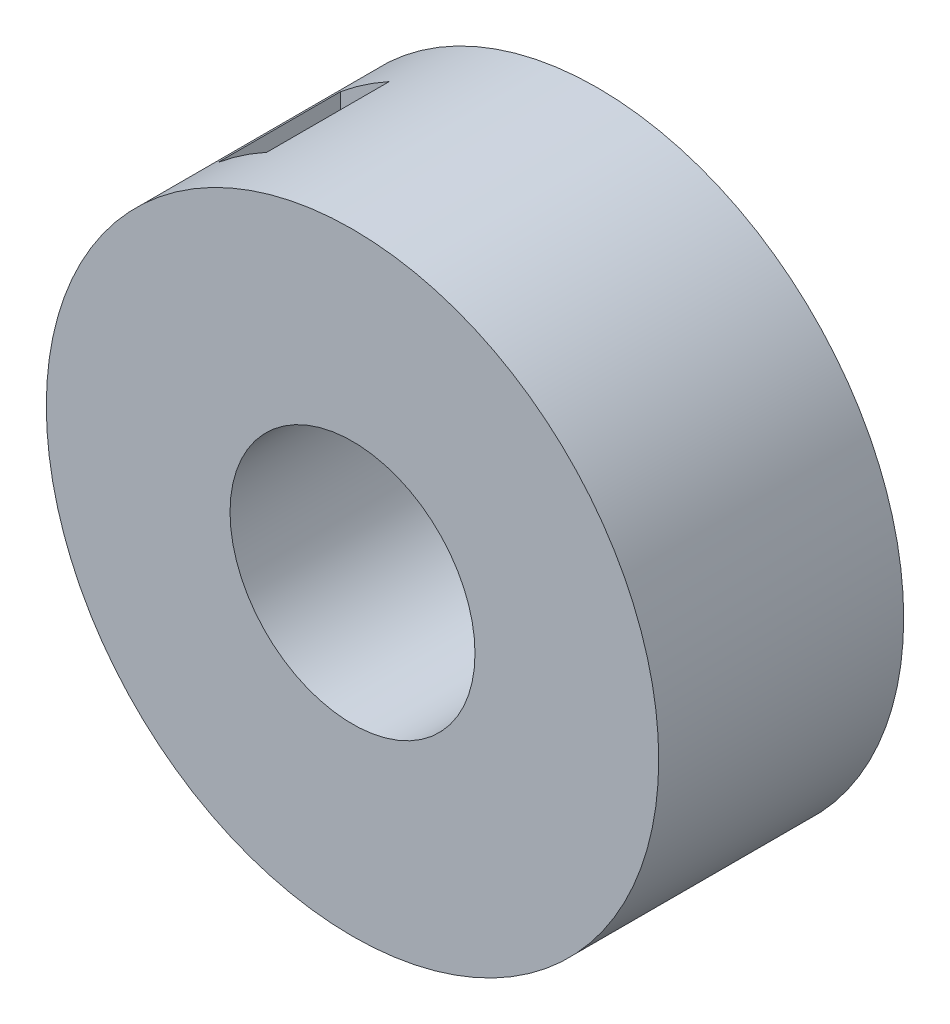
ISO-10303-21;
HEADER;
FILE_DESCRIPTION(('STEP AP214'),'2;1');
FILE_NAME('part.step','',(''),(''),'','','');
FILE_SCHEMA(('AUTOMOTIVE_DESIGN { 1 0 10303 214 1 1 1 1 }'));
ENDSEC;
DATA;
#1=APPLICATION_CONTEXT('core data for automotive mechanical design processes');
#2=APPLICATION_PROTOCOL_DEFINITION('international standard','automotive_design',2000,#1);
#3=PRODUCT_CONTEXT('',#1,'mechanical');
#4=PRODUCT('Part','Part','',(#3));
#5=PRODUCT_RELATED_PRODUCT_CATEGORY('part','',(#4));
#6=PRODUCT_DEFINITION_FORMATION('','',#4);
#7=PRODUCT_DEFINITION_CONTEXT('part definition',#1,'design');
#8=PRODUCT_DEFINITION('design','',#6,#7);
#9=PRODUCT_DEFINITION_SHAPE('','',#8);
#10=(LENGTH_UNIT() NAMED_UNIT(*) SI_UNIT(.MILLI.,.METRE.));
#11=(NAMED_UNIT(*) PLANE_ANGLE_UNIT() SI_UNIT($,.RADIAN.));
#12=(NAMED_UNIT(*) SI_UNIT($,.STERADIAN.) SOLID_ANGLE_UNIT());
#13=UNCERTAINTY_MEASURE_WITH_UNIT(LENGTH_MEASURE(1.E-05),#10,'distance_accuracy_value','');
#14=(GEOMETRIC_REPRESENTATION_CONTEXT(3) GLOBAL_UNCERTAINTY_ASSIGNED_CONTEXT((#13)) GLOBAL_UNIT_ASSIGNED_CONTEXT((#10,
#11,#12)) REPRESENTATION_CONTEXT('',''));
#15=CARTESIAN_POINT('',(0.,0.,0.));
#16=DIRECTION('',(0.,0.,1.));
#17=DIRECTION('',(1.,0.,0.));
#18=AXIS2_PLACEMENT_3D('',#15,#16,#17);
#19=CARTESIAN_POINT('',(0.,0.,-0.25));
#20=DIRECTION('',(0.,0.,1.));
#21=DIRECTION('',(1.,0.,0.));
#22=AXIS2_PLACEMENT_3D('',#19,#20,#21);
#23=CYLINDRICAL_SURFACE('',#22,0.625);
#24=CARTESIAN_POINT('',(0.,0.,0.125));
#25=DIRECTION('',(0.,0.,1.));
#26=DIRECTION('',(1.,0.,0.));
#27=AXIS2_PLACEMENT_3D('',#24,#25,#26);
#28=CIRCLE('',#27,0.625);
#29=CARTESIAN_POINT('',(-0.4,-0.480234317807463,0.125));
#30=VERTEX_POINT('',#29);
#31=CARTESIAN_POINT('',(-0.3,-0.548292804986533,0.125));
#32=VERTEX_POINT('',#31);
#33=EDGE_CURVE('E131',#30,#32,#28,.T.);
#34=ORIENTED_EDGE('',*,*,#33,.T.);
#35=DIRECTION('',(0.,0.,-1.));
#36=VECTOR('',#35,1.);
#37=CARTESIAN_POINT('',(-0.3,-0.548292804986533,0.125));
#38=LINE('',#37,#36);
#39=CARTESIAN_POINT('',(-0.3,-0.548292804986533,-0.125));
#40=VERTEX_POINT('',#39);
#41=EDGE_CURVE('E97',#32,#40,#38,.T.);
#42=ORIENTED_EDGE('',*,*,#41,.T.);
#43=CARTESIAN_POINT('',(0.,0.,-0.125));
#44=DIRECTION('',(0.,0.,1.));
#45=DIRECTION('',(1.,0.,0.));
#46=AXIS2_PLACEMENT_3D('',#43,#44,#45);
#47=CIRCLE('',#46,0.625);
#48=CARTESIAN_POINT('',(-0.4,-0.480234317807463,-0.125));
#49=VERTEX_POINT('',#48);
#50=EDGE_CURVE('E81',#49,#40,#47,.T.);
#51=ORIENTED_EDGE('',*,*,#50,.F.);
#52=DIRECTION('',(0.,0.,-1.));
#53=VECTOR('',#52,1.);
#54=CARTESIAN_POINT('',(-0.4,-0.480234317807463,0.125));
#55=LINE('',#54,#53);
#56=EDGE_CURVE('E79',#30,#49,#55,.T.);
#57=ORIENTED_EDGE('',*,*,#56,.F.);
#58=EDGE_LOOP('',(#34,#42,#51,#57));
#59=FACE_BOUND('',#58,.T.);
#60=CARTESIAN_POINT('',(0.,0.,0.125));
#61=DIRECTION('',(0.,0.,1.));
#62=DIRECTION('',(1.,0.,0.));
#63=AXIS2_PLACEMENT_3D('',#60,#61,#62);
#64=CIRCLE('',#63,0.625);
#65=CARTESIAN_POINT('',(-0.3,0.548292804986533,0.125));
#66=VERTEX_POINT('',#65);
#67=CARTESIAN_POINT('',(-0.4,0.480234317807464,0.125));
#68=VERTEX_POINT('',#67);
#69=EDGE_CURVE('E91',#66,#68,#64,.T.);
#70=ORIENTED_EDGE('',*,*,#69,.T.);
#71=DIRECTION('',(0.,0.,-1.));
#72=VECTOR('',#71,1.);
#73=CARTESIAN_POINT('',(-0.4,0.480234317807464,0.125));
#74=LINE('',#73,#72);
#75=CARTESIAN_POINT('',(-0.4,0.480234317807464,-0.125));
#76=VERTEX_POINT('',#75);
#77=EDGE_CURVE('E76',#68,#76,#74,.T.);
#78=ORIENTED_EDGE('',*,*,#77,.T.);
#79=CARTESIAN_POINT('',(0.,0.,-0.125));
#80=DIRECTION('',(0.,0.,1.));
#81=DIRECTION('',(1.,0.,0.));
#82=AXIS2_PLACEMENT_3D('',#79,#80,#81);
#83=CIRCLE('',#82,0.625);
#84=CARTESIAN_POINT('',(-0.3,0.548292804986533,-0.125));
#85=VERTEX_POINT('',#84);
#86=EDGE_CURVE('E82',#85,#76,#83,.T.);
#87=ORIENTED_EDGE('',*,*,#86,.F.);
#88=DIRECTION('',(0.,0.,-1.));
#89=VECTOR('',#88,1.);
#90=CARTESIAN_POINT('',(-0.3,0.548292804986533,0.125));
#91=LINE('',#90,#89);
#92=EDGE_CURVE('E137',#66,#85,#91,.T.);
#93=ORIENTED_EDGE('',*,*,#92,.F.);
#94=EDGE_LOOP('',(#70,#78,#87,#93));
#95=FACE_BOUND('',#94,.T.);
#96=CARTESIAN_POINT('',(0.,0.,-0.25));
#97=DIRECTION('',(0.,0.,1.));
#98=DIRECTION('',(1.,0.,0.));
#99=AXIS2_PLACEMENT_3D('',#96,#97,#98);
#100=CIRCLE('',#99,0.625);
#101=CARTESIAN_POINT('',(0.625,0.,-0.25));
#102=VERTEX_POINT('',#101);
#103=EDGE_CURVE('E11',#102,#102,#100,.T.);
#104=ORIENTED_EDGE('',*,*,#103,.T.);
#105=EDGE_LOOP('',(#104));
#106=FACE_BOUND('',#105,.T.);
#107=CARTESIAN_POINT('',(0.,0.,0.25));
#108=DIRECTION('',(0.,0.,1.));
#109=DIRECTION('',(1.,0.,0.));
#110=AXIS2_PLACEMENT_3D('',#107,#108,#109);
#111=CIRCLE('',#110,0.625);
#112=CARTESIAN_POINT('',(0.625,0.,0.25));
#113=VERTEX_POINT('',#112);
#114=EDGE_CURVE('E95',#113,#113,#111,.T.);
#115=ORIENTED_EDGE('',*,*,#114,.F.);
#116=EDGE_LOOP('',(#115));
#117=FACE_BOUND('',#116,.T.);
#118=ADVANCED_FACE('F36',(#59,#95,#106,#117),#23,.T.);
#119=CARTESIAN_POINT('',(0.,0.,-0.25));
#120=DIRECTION('',(0.,0.,1.));
#121=DIRECTION('',(1.,0.,0.));
#122=AXIS2_PLACEMENT_3D('',#119,#120,#121);
#123=PLANE('',#122);
#124=CARTESIAN_POINT('',(0.,0.,-0.25));
#125=DIRECTION('',(0.,0.,1.));
#126=DIRECTION('',(1.,0.,0.));
#127=AXIS2_PLACEMENT_3D('',#124,#125,#126);
#128=CIRCLE('',#127,0.25);
#129=CARTESIAN_POINT('',(0.25,0.,-0.25));
#130=VERTEX_POINT('',#129);
#131=EDGE_CURVE('E43',#130,#130,#128,.T.);
#132=ORIENTED_EDGE('',*,*,#131,.T.);
#133=EDGE_LOOP('',(#132));
#134=FACE_BOUND('',#133,.T.);
#135=ORIENTED_EDGE('',*,*,#103,.F.);
#136=EDGE_LOOP('',(#135));
#137=FACE_BOUND('',#136,.T.);
#138=ADVANCED_FACE('F105',(#134,#137),#123,.F.);
#139=CARTESIAN_POINT('',(0.,0.,-0.25));
#140=DIRECTION('',(0.,0.,1.));
#141=DIRECTION('',(1.,0.,0.));
#142=AXIS2_PLACEMENT_3D('',#139,#140,#141);
#143=CYLINDRICAL_SURFACE('',#142,0.25);
#144=ORIENTED_EDGE('',*,*,#131,.F.);
#145=EDGE_LOOP('',(#144));
#146=FACE_BOUND('',#145,.T.);
#147=CARTESIAN_POINT('',(0.,0.,0.25));
#148=DIRECTION('',(0.,0.,1.));
#149=DIRECTION('',(1.,0.,0.));
#150=AXIS2_PLACEMENT_3D('',#147,#148,#149);
#151=CIRCLE('',#150,0.25);
#152=CARTESIAN_POINT('',(0.25,0.,0.25));
#153=VERTEX_POINT('',#152);
#154=EDGE_CURVE('E92',#153,#153,#151,.T.);
#155=ORIENTED_EDGE('',*,*,#154,.T.);
#156=EDGE_LOOP('',(#155));
#157=FACE_BOUND('',#156,.T.);
#158=ADVANCED_FACE('F108',(#146,#157),#143,.F.);
#159=CARTESIAN_POINT('',(0.,0.,0.25));
#160=DIRECTION('',(0.,0.,1.));
#161=DIRECTION('',(1.,0.,0.));
#162=AXIS2_PLACEMENT_3D('',#159,#160,#161);
#163=PLANE('',#162);
#164=ORIENTED_EDGE('',*,*,#114,.T.);
#165=EDGE_LOOP('',(#164));
#166=FACE_BOUND('',#165,.T.);
#167=ORIENTED_EDGE('',*,*,#154,.F.);
#168=EDGE_LOOP('',(#167));
#169=FACE_BOUND('',#168,.T.);
#170=ADVANCED_FACE('F111',(#166,#169),#163,.T.);
#171=CARTESIAN_POINT('',(-0.4,-0.480234317807464,0.125));
#172=DIRECTION('',(1.,0.,0.));
#173=DIRECTION('',(0.,0.,-1.));
#174=AXIS2_PLACEMENT_3D('',#171,#172,#173);
#175=PLANE('',#174);
#176=ORIENTED_EDGE('',*,*,#77,.F.);
#177=DIRECTION('',(0.,-1.,0.));
#178=VECTOR('',#177,1.);
#179=CARTESIAN_POINT('',(-0.4,-0.480234317807464,0.125));
#180=LINE('',#179,#178);
#181=EDGE_CURVE('E135',#68,#30,#180,.T.);
#182=ORIENTED_EDGE('',*,*,#181,.T.);
#183=ORIENTED_EDGE('',*,*,#56,.T.);
#184=DIRECTION('',(0.,-1.,0.));
#185=VECTOR('',#184,1.);
#186=CARTESIAN_POINT('',(-0.4,-0.480234317807464,-0.125));
#187=LINE('',#186,#185);
#188=EDGE_CURVE('E50',#76,#49,#187,.T.);
#189=ORIENTED_EDGE('',*,*,#188,.F.);
#190=EDGE_LOOP('',(#176,#182,#183,#189));
#191=FACE_BOUND('',#190,.T.);
#192=ADVANCED_FACE('F74',(#191),#175,.T.);
#193=CARTESIAN_POINT('',(-0.3,-0.548292804986533,0.125));
#194=DIRECTION('',(-1.,0.,0.));
#195=DIRECTION('',(0.,0.,1.));
#196=AXIS2_PLACEMENT_3D('',#193,#194,#195);
#197=PLANE('',#196);
#198=ORIENTED_EDGE('',*,*,#41,.F.);
#199=DIRECTION('',(0.,1.,0.));
#200=VECTOR('',#199,1.);
#201=CARTESIAN_POINT('',(-0.3,-0.548292804986533,0.125));
#202=LINE('',#201,#200);
#203=EDGE_CURVE('E134',#32,#66,#202,.T.);
#204=ORIENTED_EDGE('',*,*,#203,.T.);
#205=ORIENTED_EDGE('',*,*,#92,.T.);
#206=DIRECTION('',(0.,1.,0.));
#207=VECTOR('',#206,1.);
#208=CARTESIAN_POINT('',(-0.3,-0.548292804986533,-0.125));
#209=LINE('',#208,#207);
#210=EDGE_CURVE('E55',#40,#85,#209,.T.);
#211=ORIENTED_EDGE('',*,*,#210,.F.);
#212=EDGE_LOOP('',(#198,#204,#205,#211));
#213=FACE_BOUND('',#212,.T.);
#214=ADVANCED_FACE('F121',(#213),#197,.T.);
#215=CARTESIAN_POINT('',(0.,0.,0.125));
#216=DIRECTION('',(0.,0.,1.));
#217=DIRECTION('',(1.,0.,0.));
#218=AXIS2_PLACEMENT_3D('',#215,#216,#217);
#219=PLANE('',#218);
#220=ORIENTED_EDGE('',*,*,#69,.F.);
#221=ORIENTED_EDGE('',*,*,#203,.F.);
#222=ORIENTED_EDGE('',*,*,#33,.F.);
#223=ORIENTED_EDGE('',*,*,#181,.F.);
#224=EDGE_LOOP('',(#220,#221,#222,#223));
#225=FACE_BOUND('',#224,.T.);
#226=ADVANCED_FACE('F143',(#225),#219,.F.);
#227=CARTESIAN_POINT('',(0.,0.,-0.125));
#228=DIRECTION('',(0.,0.,1.));
#229=DIRECTION('',(1.,0.,0.));
#230=AXIS2_PLACEMENT_3D('',#227,#228,#229);
#231=PLANE('',#230);
#232=ORIENTED_EDGE('',*,*,#86,.T.);
#233=ORIENTED_EDGE('',*,*,#188,.T.);
#234=ORIENTED_EDGE('',*,*,#50,.T.);
#235=ORIENTED_EDGE('',*,*,#210,.T.);
#236=EDGE_LOOP('',(#232,#233,#234,#235));
#237=FACE_BOUND('',#236,.T.);
#238=ADVANCED_FACE('F85',(#237),#231,.T.);
#239=CLOSED_SHELL('',(#118,#138,#158,#170,#192,#214,#226,#238));
#240=MANIFOLD_SOLID_BREP('B2',#239);
#241=ADVANCED_BREP_SHAPE_REPRESENTATION('',(#18,#240),#14);
#242=SHAPE_DEFINITION_REPRESENTATION(#9,#241);
ENDSEC;
END-ISO-10303-21;
